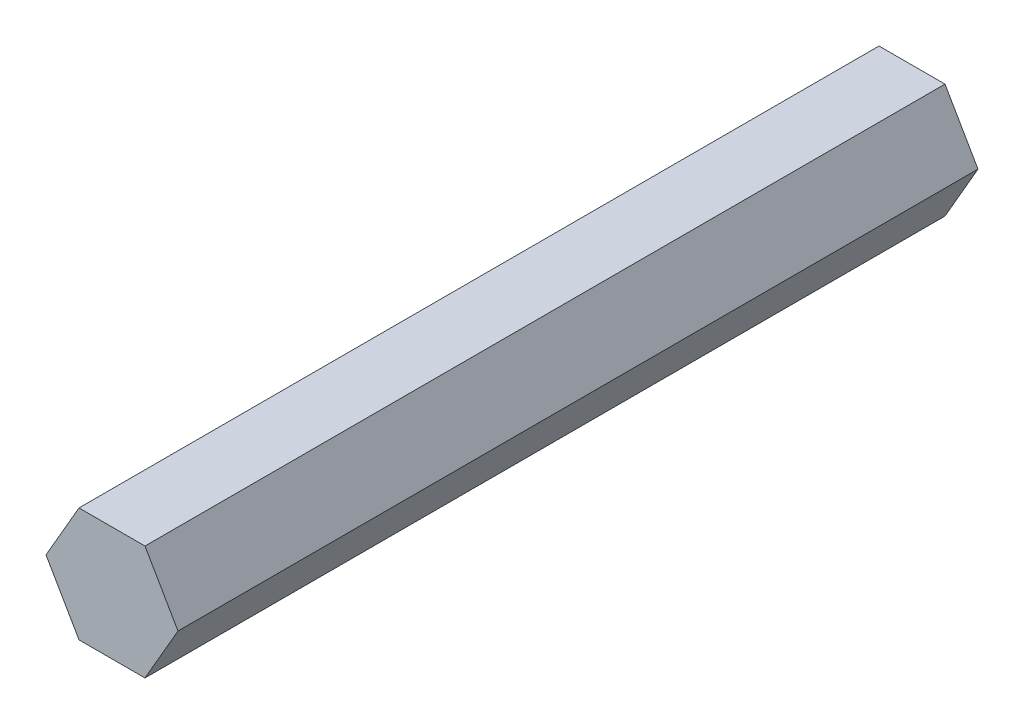
ISO-10303-21;
HEADER;
FILE_DESCRIPTION(('STEP AP214'),'2;1');
FILE_NAME('part.step','',(''),(''),'','','');
FILE_SCHEMA(('AUTOMOTIVE_DESIGN { 1 0 10303 214 1 1 1 1 }'));
ENDSEC;
DATA;
#1=APPLICATION_CONTEXT('core data for automotive mechanical design processes');
#2=APPLICATION_PROTOCOL_DEFINITION('international standard','automotive_design',2000,#1);
#3=PRODUCT_CONTEXT('',#1,'mechanical');
#4=PRODUCT('Part','Part','',(#3));
#5=PRODUCT_RELATED_PRODUCT_CATEGORY('part','',(#4));
#6=PRODUCT_DEFINITION_FORMATION('','',#4);
#7=PRODUCT_DEFINITION_CONTEXT('part definition',#1,'design');
#8=PRODUCT_DEFINITION('design','',#6,#7);
#9=PRODUCT_DEFINITION_SHAPE('','',#8);
#10=(LENGTH_UNIT() NAMED_UNIT(*) SI_UNIT(.MILLI.,.METRE.));
#11=(NAMED_UNIT(*) PLANE_ANGLE_UNIT() SI_UNIT($,.RADIAN.));
#12=(NAMED_UNIT(*) SI_UNIT($,.STERADIAN.) SOLID_ANGLE_UNIT());
#13=UNCERTAINTY_MEASURE_WITH_UNIT(LENGTH_MEASURE(1.E-05),#10,'distance_accuracy_value','');
#14=(GEOMETRIC_REPRESENTATION_CONTEXT(3) GLOBAL_UNCERTAINTY_ASSIGNED_CONTEXT((#13)) GLOBAL_UNIT_ASSIGNED_CONTEXT((#10,
#11,#12)) REPRESENTATION_CONTEXT('',''));
#15=CARTESIAN_POINT('',(0.,0.,0.));
#16=DIRECTION('',(0.,0.,1.));
#17=DIRECTION('',(1.,0.,0.));
#18=AXIS2_PLACEMENT_3D('',#15,#16,#17);
#19=CARTESIAN_POINT('',(3.6661742093542,-6.34999999999996,-88.9));
#20=DIRECTION('',(-0.866025403784441,0.499999999999995,0.));
#21=DIRECTION('',(-0.499999999999995,-0.866025403784442,0.));
#22=AXIS2_PLACEMENT_3D('',#19,#20,#21);
#23=PLANE('',#22);
#24=DIRECTION('',(0.499999999999995,0.866025403784442,0.));
#25=VECTOR('',#24,1.);
#26=CARTESIAN_POINT('',(3.6661742093542,-6.34999999999996,0.));
#27=LINE('',#26,#25);
#28=CARTESIAN_POINT('',(3.6661742093542,-6.34999999999996,0.));
#29=VERTEX_POINT('',#28);
#30=CARTESIAN_POINT('',(7.33234841870826,0.,0.));
#31=VERTEX_POINT('',#30);
#32=EDGE_CURVE('E118',#29,#31,#27,.T.);
#33=ORIENTED_EDGE('',*,*,#32,.F.);
#34=DIRECTION('',(0.,0.,1.));
#35=VECTOR('',#34,1.);
#36=CARTESIAN_POINT('',(3.6661742093542,-6.34999999999996,-88.9));
#37=LINE('',#36,#35);
#38=CARTESIAN_POINT('',(3.6661742093542,-6.34999999999996,-88.9));
#39=VERTEX_POINT('',#38);
#40=EDGE_CURVE('E117',#39,#29,#37,.T.);
#41=ORIENTED_EDGE('',*,*,#40,.F.);
#42=DIRECTION('',(0.499999999999995,0.866025403784442,0.));
#43=VECTOR('',#42,1.);
#44=CARTESIAN_POINT('',(3.6661742093542,-6.34999999999996,-88.9));
#45=LINE('',#44,#43);
#46=CARTESIAN_POINT('',(7.33234841870826,0.,-88.9));
#47=VERTEX_POINT('',#46);
#48=EDGE_CURVE('E130',#39,#47,#45,.T.);
#49=ORIENTED_EDGE('',*,*,#48,.T.);
#50=DIRECTION('',(0.,0.,1.));
#51=VECTOR('',#50,1.);
#52=CARTESIAN_POINT('',(7.33234841870826,0.,-88.9));
#53=LINE('',#52,#51);
#54=EDGE_CURVE('E11',#47,#31,#53,.T.);
#55=ORIENTED_EDGE('',*,*,#54,.T.);
#56=EDGE_LOOP('',(#33,#41,#49,#55));
#57=FACE_BOUND('',#56,.T.);
#58=ADVANCED_FACE('F35',(#57),#23,.F.);
#59=CARTESIAN_POINT('',(7.33234841870826,0.,-88.9));
#60=DIRECTION('',(-0.866025403784438,-0.500000000000001,0.));
#61=DIRECTION('',(0.500000000000001,-0.866025403784438,0.));
#62=AXIS2_PLACEMENT_3D('',#59,#60,#61);
#63=PLANE('',#62);
#64=DIRECTION('',(-0.500000000000001,0.866025403784438,0.));
#65=VECTOR('',#64,1.);
#66=CARTESIAN_POINT('',(7.33234841870826,0.,0.));
#67=LINE('',#66,#65);
#68=CARTESIAN_POINT('',(3.66617420935411,6.35000000000002,0.));
#69=VERTEX_POINT('',#68);
#70=EDGE_CURVE('E120',#31,#69,#67,.T.);
#71=ORIENTED_EDGE('',*,*,#70,.F.);
#72=ORIENTED_EDGE('',*,*,#54,.F.);
#73=DIRECTION('',(-0.500000000000001,0.866025403784438,0.));
#74=VECTOR('',#73,1.);
#75=CARTESIAN_POINT('',(7.33234841870826,0.,-88.9));
#76=LINE('',#75,#74);
#77=CARTESIAN_POINT('',(3.66617420935411,6.35000000000002,-88.9));
#78=VERTEX_POINT('',#77);
#79=EDGE_CURVE('E83',#47,#78,#76,.T.);
#80=ORIENTED_EDGE('',*,*,#79,.T.);
#81=DIRECTION('',(0.,0.,1.));
#82=VECTOR('',#81,1.);
#83=CARTESIAN_POINT('',(3.66617420935411,6.35000000000002,-88.9));
#84=LINE('',#83,#82);
#85=EDGE_CURVE('E43',#78,#69,#84,.T.);
#86=ORIENTED_EDGE('',*,*,#85,.T.);
#87=EDGE_LOOP('',(#71,#72,#80,#86));
#88=FACE_BOUND('',#87,.T.);
#89=ADVANCED_FACE('F136',(#88),#63,.F.);
#90=CARTESIAN_POINT('',(3.66617420935411,6.35000000000002,-88.9));
#91=DIRECTION('',(0.,-1.,0.));
#92=DIRECTION('',(1.,0.,0.));
#93=AXIS2_PLACEMENT_3D('',#90,#91,#92);
#94=PLANE('',#93);
#95=DIRECTION('',(-1.,0.,0.));
#96=VECTOR('',#95,1.);
#97=CARTESIAN_POINT('',(3.66617420935411,6.35000000000002,0.));
#98=LINE('',#97,#96);
#99=CARTESIAN_POINT('',(-3.66617420935416,6.34999999999999,0.));
#100=VERTEX_POINT('',#99);
#101=EDGE_CURVE('E123',#69,#100,#98,.T.);
#102=ORIENTED_EDGE('',*,*,#101,.F.);
#103=ORIENTED_EDGE('',*,*,#85,.F.);
#104=DIRECTION('',(-1.,0.,0.));
#105=VECTOR('',#104,1.);
#106=CARTESIAN_POINT('',(3.66617420935411,6.35000000000002,-88.9));
#107=LINE('',#106,#105);
#108=CARTESIAN_POINT('',(-3.66617420935416,6.34999999999999,-88.9));
#109=VERTEX_POINT('',#108);
#110=EDGE_CURVE('E111',#78,#109,#107,.T.);
#111=ORIENTED_EDGE('',*,*,#110,.T.);
#112=DIRECTION('',(0.,0.,1.));
#113=VECTOR('',#112,1.);
#114=CARTESIAN_POINT('',(-3.66617420935416,6.34999999999999,-88.9));
#115=LINE('',#114,#113);
#116=EDGE_CURVE('E105',#109,#100,#115,.T.);
#117=ORIENTED_EDGE('',*,*,#116,.T.);
#118=EDGE_LOOP('',(#102,#103,#111,#117));
#119=FACE_BOUND('',#118,.T.);
#120=ADVANCED_FACE('F158',(#119),#94,.F.);
#121=CARTESIAN_POINT('',(-3.66617420935416,6.34999999999999,-88.9));
#122=DIRECTION('',(0.866025403784441,-0.499999999999995,0.));
#123=DIRECTION('',(0.499999999999995,0.866025403784442,0.));
#124=AXIS2_PLACEMENT_3D('',#121,#122,#123);
#125=PLANE('',#124);
#126=DIRECTION('',(-0.499999999999995,-0.866025403784442,0.));
#127=VECTOR('',#126,1.);
#128=CARTESIAN_POINT('',(-3.66617420935416,6.34999999999999,0.));
#129=LINE('',#128,#127);
#130=CARTESIAN_POINT('',(-7.33234841870825,0.,0.));
#131=VERTEX_POINT('',#130);
#132=EDGE_CURVE('E126',#100,#131,#129,.T.);
#133=ORIENTED_EDGE('',*,*,#132,.F.);
#134=ORIENTED_EDGE('',*,*,#116,.F.);
#135=DIRECTION('',(-0.499999999999995,-0.866025403784442,0.));
#136=VECTOR('',#135,1.);
#137=CARTESIAN_POINT('',(-3.66617420935416,6.34999999999999,-88.9));
#138=LINE('',#137,#136);
#139=CARTESIAN_POINT('',(-7.33234841870825,0.,-88.9));
#140=VERTEX_POINT('',#139);
#141=EDGE_CURVE('E95',#109,#140,#138,.T.);
#142=ORIENTED_EDGE('',*,*,#141,.T.);
#143=DIRECTION('',(0.,0.,1.));
#144=VECTOR('',#143,1.);
#145=CARTESIAN_POINT('',(-7.33234841870825,0.,-88.9));
#146=LINE('',#145,#144);
#147=EDGE_CURVE('E100',#140,#131,#146,.T.);
#148=ORIENTED_EDGE('',*,*,#147,.T.);
#149=EDGE_LOOP('',(#133,#134,#142,#148));
#150=FACE_BOUND('',#149,.T.);
#151=ADVANCED_FACE('F108',(#150),#125,.F.);
#152=CARTESIAN_POINT('',(-7.33234841870825,0.,-88.9));
#153=DIRECTION('',(0.866025403784435,0.500000000000007,0.));
#154=DIRECTION('',(-0.500000000000007,0.866025403784435,0.));
#155=AXIS2_PLACEMENT_3D('',#152,#153,#154);
#156=PLANE('',#155);
#157=DIRECTION('',(0.500000000000007,-0.866025403784434,0.));
#158=VECTOR('',#157,1.);
#159=CARTESIAN_POINT('',(-7.33234841870825,0.,0.));
#160=LINE('',#159,#158);
#161=CARTESIAN_POINT('',(-3.66617420935407,-6.35000000000004,0.));
#162=VERTEX_POINT('',#161);
#163=EDGE_CURVE('E102',#131,#162,#160,.T.);
#164=ORIENTED_EDGE('',*,*,#163,.F.);
#165=ORIENTED_EDGE('',*,*,#147,.F.);
#166=DIRECTION('',(0.500000000000007,-0.866025403784434,0.));
#167=VECTOR('',#166,1.);
#168=CARTESIAN_POINT('',(-7.33234841870825,0.,-88.9));
#169=LINE('',#168,#167);
#170=CARTESIAN_POINT('',(-3.66617420935407,-6.35000000000004,-88.9));
#171=VERTEX_POINT('',#170);
#172=EDGE_CURVE('E91',#140,#171,#169,.T.);
#173=ORIENTED_EDGE('',*,*,#172,.T.);
#174=DIRECTION('',(0.,0.,1.));
#175=VECTOR('',#174,1.);
#176=CARTESIAN_POINT('',(-3.66617420935407,-6.35000000000004,-88.9));
#177=LINE('',#176,#175);
#178=EDGE_CURVE('E106',#171,#162,#177,.T.);
#179=ORIENTED_EDGE('',*,*,#178,.T.);
#180=EDGE_LOOP('',(#164,#165,#173,#179));
#181=FACE_BOUND('',#180,.T.);
#182=ADVANCED_FACE('F101',(#181),#156,.F.);
#183=CARTESIAN_POINT('',(-3.66617420935407,-6.35000000000004,-88.9));
#184=DIRECTION('',(0.,1.,0.));
#185=DIRECTION('',(-1.,0.,0.));
#186=AXIS2_PLACEMENT_3D('',#183,#184,#185);
#187=PLANE('',#186);
#188=DIRECTION('',(1.,0.,0.));
#189=VECTOR('',#188,1.);
#190=CARTESIAN_POINT('',(-3.66617420935407,-6.35000000000004,0.));
#191=LINE('',#190,#189);
#192=EDGE_CURVE('E71',#162,#29,#191,.T.);
#193=ORIENTED_EDGE('',*,*,#192,.F.);
#194=ORIENTED_EDGE('',*,*,#178,.F.);
#195=DIRECTION('',(1.,0.,0.));
#196=VECTOR('',#195,1.);
#197=CARTESIAN_POINT('',(-3.66617420935407,-6.35000000000004,-88.9));
#198=LINE('',#197,#196);
#199=EDGE_CURVE('E51',#171,#39,#198,.T.);
#200=ORIENTED_EDGE('',*,*,#199,.T.);
#201=ORIENTED_EDGE('',*,*,#40,.T.);
#202=EDGE_LOOP('',(#193,#194,#200,#201));
#203=FACE_BOUND('',#202,.T.);
#204=ADVANCED_FACE('F144',(#203),#187,.F.);
#205=CARTESIAN_POINT('',(0.,0.,-88.9));
#206=DIRECTION('',(0.,0.,-1.));
#207=DIRECTION('',(1.,0.,0.));
#208=AXIS2_PLACEMENT_3D('',#205,#206,#207);
#209=PLANE('',#208);
#210=ORIENTED_EDGE('',*,*,#48,.F.);
#211=ORIENTED_EDGE('',*,*,#199,.F.);
#212=ORIENTED_EDGE('',*,*,#172,.F.);
#213=ORIENTED_EDGE('',*,*,#141,.F.);
#214=ORIENTED_EDGE('',*,*,#110,.F.);
#215=ORIENTED_EDGE('',*,*,#79,.F.);
#216=EDGE_LOOP('',(#210,#211,#212,#213,#214,#215));
#217=FACE_BOUND('',#216,.T.);
#218=ADVANCED_FACE('F93',(#217),#209,.T.);
#219=CARTESIAN_POINT('',(0.,0.,0.));
#220=DIRECTION('',(0.,0.,-1.));
#221=DIRECTION('',(1.,0.,0.));
#222=AXIS2_PLACEMENT_3D('',#219,#220,#221);
#223=PLANE('',#222);
#224=ORIENTED_EDGE('',*,*,#32,.T.);
#225=ORIENTED_EDGE('',*,*,#70,.T.);
#226=ORIENTED_EDGE('',*,*,#101,.T.);
#227=ORIENTED_EDGE('',*,*,#132,.T.);
#228=ORIENTED_EDGE('',*,*,#163,.T.);
#229=ORIENTED_EDGE('',*,*,#192,.T.);
#230=EDGE_LOOP('',(#224,#225,#226,#227,#228,#229));
#231=FACE_BOUND('',#230,.T.);
#232=ADVANCED_FACE('F138',(#231),#223,.F.);
#233=CLOSED_SHELL('',(#58,#89,#120,#151,#182,#204,#218,#232));
#234=MANIFOLD_SOLID_BREP('B2',#233);
#235=ADVANCED_BREP_SHAPE_REPRESENTATION('',(#18,#234),#14);
#236=SHAPE_DEFINITION_REPRESENTATION(#9,#235);
ENDSEC;
END-ISO-10303-21;
